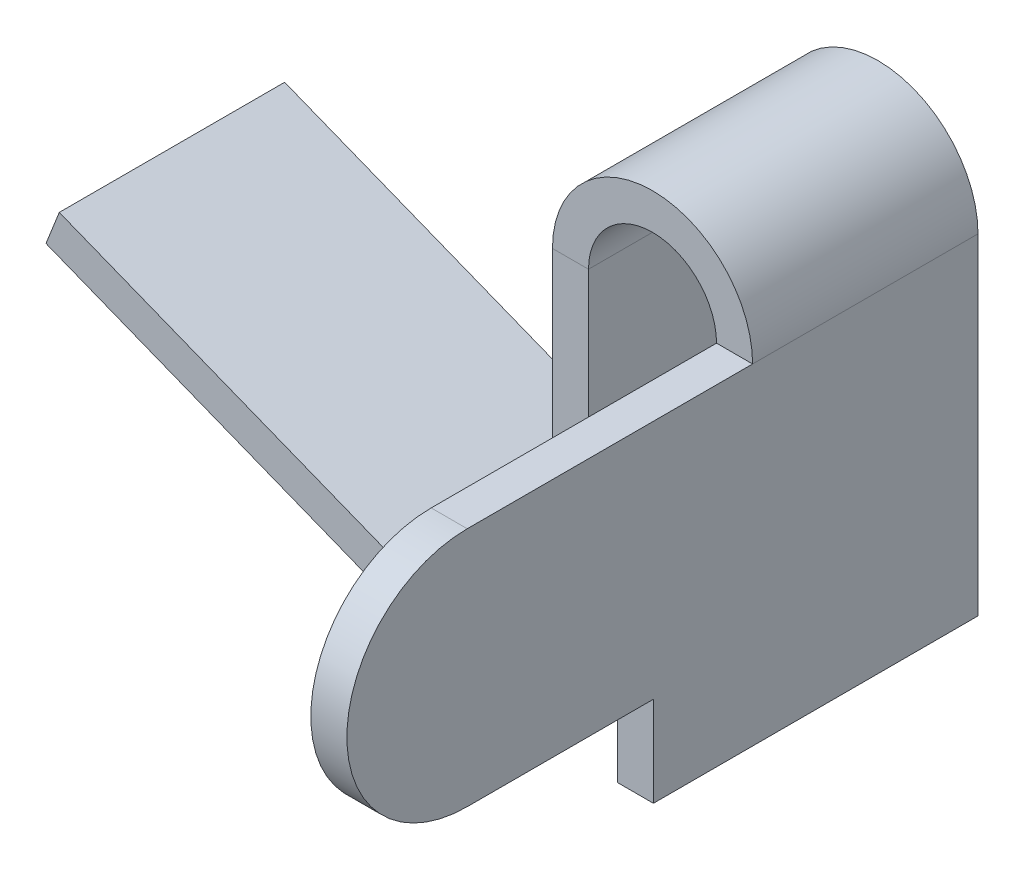
ISO-10303-21;
HEADER;
FILE_DESCRIPTION(('STEP AP214'),'2;1');
FILE_NAME('part.step','',(''),(''),'','','');
FILE_SCHEMA(('AUTOMOTIVE_DESIGN { 1 0 10303 214 1 1 1 1 }'));
ENDSEC;
DATA;
#1=APPLICATION_CONTEXT('core data for automotive mechanical design processes');
#2=APPLICATION_PROTOCOL_DEFINITION('international standard','automotive_design',2000,#1);
#3=PRODUCT_CONTEXT('',#1,'mechanical');
#4=PRODUCT('Part','Part','',(#3));
#5=PRODUCT_RELATED_PRODUCT_CATEGORY('part','',(#4));
#6=PRODUCT_DEFINITION_FORMATION('','',#4);
#7=PRODUCT_DEFINITION_CONTEXT('part definition',#1,'design');
#8=PRODUCT_DEFINITION('design','',#6,#7);
#9=PRODUCT_DEFINITION_SHAPE('','',#8);
#10=(LENGTH_UNIT() NAMED_UNIT(*) SI_UNIT(.MILLI.,.METRE.));
#11=(NAMED_UNIT(*) PLANE_ANGLE_UNIT() SI_UNIT($,.RADIAN.));
#12=(NAMED_UNIT(*) SI_UNIT($,.STERADIAN.) SOLID_ANGLE_UNIT());
#13=UNCERTAINTY_MEASURE_WITH_UNIT(LENGTH_MEASURE(1.E-05),#10,'distance_accuracy_value','');
#14=(GEOMETRIC_REPRESENTATION_CONTEXT(3) GLOBAL_UNCERTAINTY_ASSIGNED_CONTEXT((#13)) GLOBAL_UNIT_ASSIGNED_CONTEXT((#10,
#11,#12)) REPRESENTATION_CONTEXT('',''));
#15=CARTESIAN_POINT('',(0.,0.,0.));
#16=DIRECTION('',(0.,0.,1.));
#17=DIRECTION('',(1.,0.,0.));
#18=AXIS2_PLACEMENT_3D('',#15,#16,#17);
#19=CARTESIAN_POINT('',(0.709999999999978,2.335,5.665));
#20=DIRECTION('',(-1.,0.,0.));
#21=DIRECTION('',(0.,-1.,0.));
#22=AXIS2_PLACEMENT_3D('',#19,#20,#21);
#23=CYLINDRICAL_SURFACE('',#22,1.33499999999999);
#24=DIRECTION('',(1.,0.,0.));
#25=VECTOR('',#24,1.);
#26=CARTESIAN_POINT('',(0.709999999999999,3.66999999999999,5.665));
#27=LINE('',#26,#25);
#28=CARTESIAN_POINT('',(0.71,3.66999999999999,5.665));
#29=VERTEX_POINT('',#28);
#30=CARTESIAN_POINT('',(1.11,3.66999999999998,5.66500000000001));
#31=VERTEX_POINT('',#30);
#32=EDGE_CURVE('E205',#29,#31,#27,.T.);
#33=ORIENTED_EDGE('',*,*,#32,.F.);
#34=CARTESIAN_POINT('',(0.71,2.335,5.665));
#35=DIRECTION('',(-1.,0.,0.));
#36=DIRECTION('',(0.,0.,1.));
#37=AXIS2_PLACEMENT_3D('',#34,#35,#36);
#38=CIRCLE('',#37,1.33499999999999);
#39=CARTESIAN_POINT('',(0.71,1.,5.665));
#40=VERTEX_POINT('',#39);
#41=EDGE_CURVE('E43',#40,#29,#38,.T.);
#42=ORIENTED_EDGE('',*,*,#41,.F.);
#43=DIRECTION('',(1.,0.,0.));
#44=VECTOR('',#43,1.);
#45=CARTESIAN_POINT('',(0.71,1.,5.665));
#46=LINE('',#45,#44);
#47=CARTESIAN_POINT('',(1.11,1.,5.66500000000001));
#48=VERTEX_POINT('',#47);
#49=EDGE_CURVE('E208',#48,#40,#46,.F.);
#50=ORIENTED_EDGE('',*,*,#49,.F.);
#51=CARTESIAN_POINT('',(1.11,2.33499999999999,5.665));
#52=DIRECTION('',(-1.,0.,0.));
#53=DIRECTION('',(0.,0.,1.));
#54=AXIS2_PLACEMENT_3D('',#51,#52,#53);
#55=CIRCLE('',#54,1.33499999999999);
#56=EDGE_CURVE('E11',#31,#48,#55,.F.);
#57=ORIENTED_EDGE('',*,*,#56,.F.);
#58=EDGE_LOOP('',(#33,#42,#50,#57));
#59=FACE_BOUND('',#58,.T.);
#60=ADVANCED_FACE('F36',(#59),#23,.T.);
#61=CARTESIAN_POINT('',(0.71,0.,2.5));
#62=DIRECTION('',(-1.,0.,0.));
#63=DIRECTION('',(0.,0.,1.));
#64=AXIS2_PLACEMENT_3D('',#61,#62,#63);
#65=PLANE('',#64);
#66=DIRECTION('',(0.,0.,-1.));
#67=VECTOR('',#66,1.);
#68=CARTESIAN_POINT('',(0.71,1.,2.5));
#69=LINE('',#68,#67);
#70=CARTESIAN_POINT('',(0.71,1.,3.6));
#71=VERTEX_POINT('',#70);
#72=EDGE_CURVE('E214',#40,#71,#69,.T.);
#73=ORIENTED_EDGE('',*,*,#72,.F.);
#74=ORIENTED_EDGE('',*,*,#41,.T.);
#75=DIRECTION('',(0.,0.,-1.));
#76=VECTOR('',#75,1.);
#77=CARTESIAN_POINT('',(0.71,3.66999999999999,7.));
#78=LINE('',#77,#76);
#79=CARTESIAN_POINT('',(0.71,3.66999999999999,2.5));
#80=VERTEX_POINT('',#79);
#81=EDGE_CURVE('E213',#29,#80,#78,.T.);
#82=ORIENTED_EDGE('',*,*,#81,.T.);
#83=DIRECTION('',(0.,0.,-1.));
#84=VECTOR('',#83,1.);
#85=CARTESIAN_POINT('',(0.71,3.66999999999999,2.5));
#86=LINE('',#85,#84);
#87=CARTESIAN_POINT('',(0.71,3.66999999999999,0.));
#88=VERTEX_POINT('',#87);
#89=EDGE_CURVE('E166',#80,#88,#86,.T.);
#90=ORIENTED_EDGE('',*,*,#89,.T.);
#91=DIRECTION('',(0.,1.,0.));
#92=VECTOR('',#91,1.);
#93=CARTESIAN_POINT('',(0.71,0.,0.));
#94=LINE('',#93,#92);
#95=CARTESIAN_POINT('',(0.71,0.,0.));
#96=VERTEX_POINT('',#95);
#97=EDGE_CURVE('E270',#96,#88,#94,.T.);
#98=ORIENTED_EDGE('',*,*,#97,.F.);
#99=DIRECTION('',(0.,0.,-1.));
#100=VECTOR('',#99,1.);
#101=CARTESIAN_POINT('',(0.71,0.,2.5));
#102=LINE('',#101,#100);
#103=CARTESIAN_POINT('',(0.71,0.,3.6));
#104=VERTEX_POINT('',#103);
#105=EDGE_CURVE('E163',#104,#96,#102,.T.);
#106=ORIENTED_EDGE('',*,*,#105,.F.);
#107=DIRECTION('',(0.,-1.,0.));
#108=VECTOR('',#107,1.);
#109=CARTESIAN_POINT('',(0.71,0.,3.6));
#110=LINE('',#109,#108);
#111=EDGE_CURVE('E146',#71,#104,#110,.T.);
#112=ORIENTED_EDGE('',*,*,#111,.F.);
#113=EDGE_LOOP('',(#73,#74,#82,#90,#98,#106,#112));
#114=FACE_BOUND('',#113,.T.);
#115=ADVANCED_FACE('F211',(#114),#65,.T.);
#116=CARTESIAN_POINT('',(1.11,0.,2.5));
#117=DIRECTION('',(0.,-1.,0.));
#118=DIRECTION('',(0.,0.,-1.));
#119=AXIS2_PLACEMENT_3D('',#116,#117,#118);
#120=PLANE('',#119);
#121=DIRECTION('',(0.,0.,-1.));
#122=VECTOR('',#121,1.);
#123=CARTESIAN_POINT('',(1.11,0.,2.5));
#124=LINE('',#123,#122);
#125=CARTESIAN_POINT('',(1.11,0.,3.6));
#126=VERTEX_POINT('',#125);
#127=CARTESIAN_POINT('',(1.11,0.,0.));
#128=VERTEX_POINT('',#127);
#129=EDGE_CURVE('E154',#126,#128,#124,.T.);
#130=ORIENTED_EDGE('',*,*,#129,.F.);
#131=DIRECTION('',(-1.,0.,0.));
#132=VECTOR('',#131,1.);
#133=CARTESIAN_POINT('',(0.71,0.,3.6));
#134=LINE('',#133,#132);
#135=EDGE_CURVE('E139',#104,#126,#134,.F.);
#136=ORIENTED_EDGE('',*,*,#135,.F.);
#137=ORIENTED_EDGE('',*,*,#105,.T.);
#138=DIRECTION('',(-1.,0.,0.));
#139=VECTOR('',#138,1.);
#140=CARTESIAN_POINT('',(1.11,0.,0.));
#141=LINE('',#140,#139);
#142=EDGE_CURVE('E162',#128,#96,#141,.T.);
#143=ORIENTED_EDGE('',*,*,#142,.F.);
#144=EDGE_LOOP('',(#130,#136,#137,#143));
#145=FACE_BOUND('',#144,.T.);
#146=ADVANCED_FACE('F160',(#145),#120,.T.);
#147=CARTESIAN_POINT('',(1.11,0.,2.5));
#148=DIRECTION('',(-1.,0.,0.));
#149=DIRECTION('',(0.,0.,1.));
#150=AXIS2_PLACEMENT_3D('',#147,#148,#149);
#151=PLANE('',#150);
#152=DIRECTION('',(0.,0.,-1.));
#153=VECTOR('',#152,1.);
#154=CARTESIAN_POINT('',(1.11,3.66999999999998,7.));
#155=LINE('',#154,#153);
#156=CARTESIAN_POINT('',(1.11,3.66999999999998,2.5));
#157=VERTEX_POINT('',#156);
#158=EDGE_CURVE('E219',#31,#157,#155,.T.);
#159=ORIENTED_EDGE('',*,*,#158,.F.);
#160=ORIENTED_EDGE('',*,*,#56,.T.);
#161=DIRECTION('',(0.,0.,1.));
#162=VECTOR('',#161,1.);
#163=CARTESIAN_POINT('',(1.11,1.,2.5));
#164=LINE('',#163,#162);
#165=CARTESIAN_POINT('',(1.11,1.,3.6));
#166=VERTEX_POINT('',#165);
#167=EDGE_CURVE('E157',#48,#166,#164,.F.);
#168=ORIENTED_EDGE('',*,*,#167,.T.);
#169=DIRECTION('',(0.,1.,0.));
#170=VECTOR('',#169,1.);
#171=CARTESIAN_POINT('',(1.11,0.,3.6));
#172=LINE('',#171,#170);
#173=EDGE_CURVE('E143',#166,#126,#172,.F.);
#174=ORIENTED_EDGE('',*,*,#173,.T.);
#175=ORIENTED_EDGE('',*,*,#129,.T.);
#176=DIRECTION('',(0.,1.,0.));
#177=VECTOR('',#176,1.);
#178=CARTESIAN_POINT('',(1.11,0.,0.));
#179=LINE('',#178,#177);
#180=CARTESIAN_POINT('',(1.11,3.66999999999998,0.));
#181=VERTEX_POINT('',#180);
#182=EDGE_CURVE('E274',#128,#181,#179,.T.);
#183=ORIENTED_EDGE('',*,*,#182,.T.);
#184=DIRECTION('',(0.,0.,-1.));
#185=VECTOR('',#184,1.);
#186=CARTESIAN_POINT('',(1.11,3.66999999999998,2.5));
#187=LINE('',#186,#185);
#188=EDGE_CURVE('E164',#157,#181,#187,.T.);
#189=ORIENTED_EDGE('',*,*,#188,.F.);
#190=EDGE_LOOP('',(#159,#160,#168,#174,#175,#183,#189));
#191=FACE_BOUND('',#190,.T.);
#192=ADVANCED_FACE('F152',(#191),#151,.F.);
#193=CARTESIAN_POINT('',(-0.71,3.67,2.5));
#194=DIRECTION('',(0.,0.,1.));
#195=DIRECTION('',(1.,0.,0.));
#196=AXIS2_PLACEMENT_3D('',#193,#194,#195);
#197=PLANE('',#196);
#198=DIRECTION('',(-1.,0.,0.));
#199=VECTOR('',#198,1.);
#200=CARTESIAN_POINT('',(-0.71,3.67,2.5));
#201=LINE('',#200,#199);
#202=CARTESIAN_POINT('',(-0.71,3.67,2.5));
#203=VERTEX_POINT('',#202);
#204=CARTESIAN_POINT('',(-1.11,3.67,2.5));
#205=VERTEX_POINT('',#204);
#206=EDGE_CURVE('E203',#203,#205,#201,.T.);
#207=ORIENTED_EDGE('',*,*,#206,.F.);
#208=CARTESIAN_POINT('',(0.,3.67,2.5));
#209=DIRECTION('',(0.,0.,1.));
#210=DIRECTION('',(1.,0.,0.));
#211=AXIS2_PLACEMENT_3D('',#208,#209,#210);
#212=CIRCLE('',#211,0.71);
#213=EDGE_CURVE('E240',#80,#203,#212,.T.);
#214=ORIENTED_EDGE('',*,*,#213,.F.);
#215=DIRECTION('',(-1.,0.,0.));
#216=VECTOR('',#215,1.);
#217=CARTESIAN_POINT('',(1.11,3.66999999999998,2.5));
#218=LINE('',#217,#216);
#219=EDGE_CURVE('E200',#157,#80,#218,.T.);
#220=ORIENTED_EDGE('',*,*,#219,.F.);
#221=CARTESIAN_POINT('',(0.,3.67,2.5));
#222=DIRECTION('',(0.,0.,1.));
#223=DIRECTION('',(1.,0.,0.));
#224=AXIS2_PLACEMENT_3D('',#221,#222,#223);
#225=CIRCLE('',#224,1.11);
#226=EDGE_CURVE('E243',#157,#205,#225,.T.);
#227=ORIENTED_EDGE('',*,*,#226,.T.);
#228=EDGE_LOOP('',(#207,#214,#220,#227));
#229=FACE_BOUND('',#228,.T.);
#230=ADVANCED_FACE('F338',(#229),#197,.T.);
#231=CARTESIAN_POINT('',(1.11,3.66999999999998,2.5));
#232=DIRECTION('',(0.,0.,1.));
#233=DIRECTION('',(1.,0.,0.));
#234=AXIS2_PLACEMENT_3D('',#231,#232,#233);
#235=PLANE('',#234);
#236=DIRECTION('',(0.,-1.,0.));
#237=VECTOR('',#236,1.);
#238=CARTESIAN_POINT('',(-0.71,3.67,2.5));
#239=LINE('',#238,#237);
#240=CARTESIAN_POINT('',(-0.71,-0.5,2.5));
#241=VERTEX_POINT('',#240);
#242=EDGE_CURVE('E237',#203,#241,#239,.T.);
#243=ORIENTED_EDGE('',*,*,#242,.F.);
#244=ORIENTED_EDGE('',*,*,#206,.T.);
#245=DIRECTION('',(0.,-1.,0.));
#246=VECTOR('',#245,1.);
#247=CARTESIAN_POINT('',(-1.11,3.67,2.5));
#248=LINE('',#247,#246);
#249=CARTESIAN_POINT('',(-1.11,-0.5,2.5));
#250=VERTEX_POINT('',#249);
#251=EDGE_CURVE('E246',#205,#250,#248,.T.);
#252=ORIENTED_EDGE('',*,*,#251,.T.);
#253=DIRECTION('',(1.,0.,0.));
#254=VECTOR('',#253,1.);
#255=CARTESIAN_POINT('',(-1.11,-0.5,2.5));
#256=LINE('',#255,#254);
#257=EDGE_CURVE('E192',#250,#241,#256,.T.);
#258=ORIENTED_EDGE('',*,*,#257,.T.);
#259=EDGE_LOOP('',(#243,#244,#252,#258));
#260=FACE_BOUND('',#259,.T.);
#261=ADVANCED_FACE('F335',(#260),#235,.T.);
#262=CARTESIAN_POINT('',(0.71,3.66999999999999,0.));
#263=DIRECTION('',(0.,0.,-1.));
#264=DIRECTION('',(-1.,0.,0.));
#265=AXIS2_PLACEMENT_3D('',#262,#263,#264);
#266=PLANE('',#265);
#267=DIRECTION('',(1.,0.,0.));
#268=VECTOR('',#267,1.);
#269=CARTESIAN_POINT('',(0.71,3.66999999999999,0.));
#270=LINE('',#269,#268);
#271=EDGE_CURVE('E198',#88,#181,#270,.T.);
#272=ORIENTED_EDGE('',*,*,#271,.F.);
#273=CARTESIAN_POINT('',(0.,3.67,0.));
#274=DIRECTION('',(0.,0.,1.));
#275=DIRECTION('',(1.,0.,0.));
#276=AXIS2_PLACEMENT_3D('',#273,#274,#275);
#277=CIRCLE('',#276,0.71);
#278=CARTESIAN_POINT('',(-0.71,3.67,0.));
#279=VERTEX_POINT('',#278);
#280=EDGE_CURVE('E267',#88,#279,#277,.T.);
#281=ORIENTED_EDGE('',*,*,#280,.T.);
#282=DIRECTION('',(1.,0.,0.));
#283=VECTOR('',#282,1.);
#284=CARTESIAN_POINT('',(-1.11,3.67,0.));
#285=LINE('',#284,#283);
#286=CARTESIAN_POINT('',(-1.11,3.67,0.));
#287=VERTEX_POINT('',#286);
#288=EDGE_CURVE('E196',#287,#279,#285,.T.);
#289=ORIENTED_EDGE('',*,*,#288,.F.);
#290=CARTESIAN_POINT('',(0.,3.67,0.));
#291=DIRECTION('',(0.,0.,1.));
#292=DIRECTION('',(1.,0.,0.));
#293=AXIS2_PLACEMENT_3D('',#290,#291,#292);
#294=CIRCLE('',#293,1.11);
#295=EDGE_CURVE('E276',#181,#287,#294,.T.);
#296=ORIENTED_EDGE('',*,*,#295,.F.);
#297=EDGE_LOOP('',(#272,#281,#289,#296));
#298=FACE_BOUND('',#297,.T.);
#299=ADVANCED_FACE('F343',(#298),#266,.T.);
#300=CARTESIAN_POINT('',(-1.11,3.67,0.));
#301=DIRECTION('',(0.,0.,-1.));
#302=DIRECTION('',(-1.,0.,0.));
#303=AXIS2_PLACEMENT_3D('',#300,#301,#302);
#304=PLANE('',#303);
#305=ORIENTED_EDGE('',*,*,#97,.T.);
#306=ORIENTED_EDGE('',*,*,#271,.T.);
#307=ORIENTED_EDGE('',*,*,#182,.F.);
#308=ORIENTED_EDGE('',*,*,#142,.T.);
#309=EDGE_LOOP('',(#305,#306,#307,#308));
#310=FACE_BOUND('',#309,.T.);
#311=ADVANCED_FACE('F349',(#310),#304,.T.);
#312=CARTESIAN_POINT('',(-1.61274798484912,-1.1137372531073,2.5));
#313=DIRECTION('',(0.,0.,1.));
#314=DIRECTION('',(1.,0.,0.));
#315=AXIS2_PLACEMENT_3D('',#312,#313,#314);
#316=PLANE('',#315);
#317=DIRECTION('',(0.367799977044115,0.929904928950454,0.));
#318=VECTOR('',#317,1.);
#319=CARTESIAN_POINT('',(-1.61274798484912,-1.1137372531073,2.5));
#320=LINE('',#319,#318);
#321=CARTESIAN_POINT('',(-1.61274798484912,-1.1137372531073,2.5));
#322=VERTEX_POINT('',#321);
#323=CARTESIAN_POINT('',(-1.46562799403147,-0.741775281527118,2.5));
#324=VERTEX_POINT('',#323);
#325=EDGE_CURVE('E194',#322,#324,#320,.T.);
#326=ORIENTED_EDGE('',*,*,#325,.F.);
#327=CARTESIAN_POINT('',(-1.37,-0.5,2.5));
#328=DIRECTION('',(0.,0.,-1.));
#329=DIRECTION('',(-1.,0.,0.));
#330=AXIS2_PLACEMENT_3D('',#327,#328,#329);
#331=CIRCLE('',#330,0.66);
#332=EDGE_CURVE('E234',#241,#322,#331,.T.);
#333=ORIENTED_EDGE('',*,*,#332,.F.);
#334=ORIENTED_EDGE('',*,*,#257,.F.);
#335=CARTESIAN_POINT('',(-1.37,-0.5,2.5));
#336=DIRECTION('',(0.,0.,1.));
#337=DIRECTION('',(1.,0.,0.));
#338=AXIS2_PLACEMENT_3D('',#335,#336,#337);
#339=CIRCLE('',#338,0.26);
#340=EDGE_CURVE('E249',#250,#324,#339,.F.);
#341=ORIENTED_EDGE('',*,*,#340,.T.);
#342=EDGE_LOOP('',(#326,#333,#334,#341));
#343=FACE_BOUND('',#342,.T.);
#344=ADVANCED_FACE('F333',(#343),#316,.T.);
#345=CARTESIAN_POINT('',(-1.11,-0.5,2.5));
#346=DIRECTION('',(0.,0.,1.));
#347=DIRECTION('',(1.,0.,0.));
#348=AXIS2_PLACEMENT_3D('',#345,#346,#347);
#349=PLANE('',#348);
#350=DIRECTION('',(-0.929904928950454,0.367799977044115,0.));
#351=VECTOR('',#350,1.);
#352=CARTESIAN_POINT('',(-1.61274798484912,-1.1137372531073,2.5));
#353=LINE('',#352,#351);
#354=CARTESIAN_POINT('',(-6.72722509407661,0.909162620635334,2.5));
#355=VERTEX_POINT('',#354);
#356=EDGE_CURVE('E231',#322,#355,#353,.T.);
#357=ORIENTED_EDGE('',*,*,#356,.F.);
#358=ORIENTED_EDGE('',*,*,#325,.T.);
#359=DIRECTION('',(-0.929904928950454,0.367799977044115,0.));
#360=VECTOR('',#359,1.);
#361=CARTESIAN_POINT('',(-1.46562799403147,-0.741775281527118,2.5));
#362=LINE('',#361,#360);
#363=CARTESIAN_POINT('',(-6.58010510325897,1.28112459221552,2.5));
#364=VERTEX_POINT('',#363);
#365=EDGE_CURVE('E225',#324,#364,#362,.T.);
#366=ORIENTED_EDGE('',*,*,#365,.T.);
#367=DIRECTION('',(0.367799977044113,0.929904928950455,0.));
#368=VECTOR('',#367,1.);
#369=CARTESIAN_POINT('',(-6.72722509407661,0.909162620635334,2.5));
#370=LINE('',#369,#368);
#371=EDGE_CURVE('E227',#355,#364,#370,.T.);
#372=ORIENTED_EDGE('',*,*,#371,.F.);
#373=EDGE_LOOP('',(#357,#358,#366,#372));
#374=FACE_BOUND('',#373,.T.);
#375=ADVANCED_FACE('F331',(#374),#349,.T.);
#376=CARTESIAN_POINT('',(-0.71,-0.5,0.));
#377=DIRECTION('',(0.,0.,-1.));
#378=DIRECTION('',(-1.,0.,0.));
#379=AXIS2_PLACEMENT_3D('',#376,#377,#378);
#380=PLANE('',#379);
#381=DIRECTION('',(-1.,0.,0.));
#382=VECTOR('',#381,1.);
#383=CARTESIAN_POINT('',(-0.71,-0.5,0.));
#384=LINE('',#383,#382);
#385=CARTESIAN_POINT('',(-0.71,-0.5,0.));
#386=VERTEX_POINT('',#385);
#387=CARTESIAN_POINT('',(-1.11,-0.5,0.));
#388=VERTEX_POINT('',#387);
#389=EDGE_CURVE('E190',#386,#388,#384,.T.);
#390=ORIENTED_EDGE('',*,*,#389,.F.);
#391=CARTESIAN_POINT('',(-1.37,-0.5,0.));
#392=DIRECTION('',(0.,0.,-1.));
#393=DIRECTION('',(-1.,0.,0.));
#394=AXIS2_PLACEMENT_3D('',#391,#392,#393);
#395=CIRCLE('',#394,0.66);
#396=CARTESIAN_POINT('',(-1.61274798484912,-1.1137372531073,0.));
#397=VERTEX_POINT('',#396);
#398=EDGE_CURVE('E261',#386,#397,#395,.T.);
#399=ORIENTED_EDGE('',*,*,#398,.T.);
#400=DIRECTION('',(-0.367799977044115,-0.929904928950454,0.));
#401=VECTOR('',#400,1.);
#402=CARTESIAN_POINT('',(-1.46562799403147,-0.741775281527118,0.));
#403=LINE('',#402,#401);
#404=CARTESIAN_POINT('',(-1.46562799403147,-0.741775281527118,0.));
#405=VERTEX_POINT('',#404);
#406=EDGE_CURVE('E188',#405,#397,#403,.T.);
#407=ORIENTED_EDGE('',*,*,#406,.F.);
#408=CARTESIAN_POINT('',(-1.37,-0.5,0.));
#409=DIRECTION('',(0.,0.,1.));
#410=DIRECTION('',(1.,0.,0.));
#411=AXIS2_PLACEMENT_3D('',#408,#409,#410);
#412=CIRCLE('',#411,0.26);
#413=EDGE_CURVE('E228',#388,#405,#412,.F.);
#414=ORIENTED_EDGE('',*,*,#413,.F.);
#415=EDGE_LOOP('',(#390,#399,#407,#414));
#416=FACE_BOUND('',#415,.T.);
#417=ADVANCED_FACE('F302',(#416),#380,.T.);
#418=CARTESIAN_POINT('',(-1.46562799403147,-0.741775281527118,0.));
#419=DIRECTION('',(0.,0.,-1.));
#420=DIRECTION('',(-1.,0.,0.));
#421=AXIS2_PLACEMENT_3D('',#418,#419,#420);
#422=PLANE('',#421);
#423=DIRECTION('',(0.,-1.,0.));
#424=VECTOR('',#423,1.);
#425=CARTESIAN_POINT('',(-0.71,3.67,0.));
#426=LINE('',#425,#424);
#427=EDGE_CURVE('E264',#279,#386,#426,.T.);
#428=ORIENTED_EDGE('',*,*,#427,.T.);
#429=ORIENTED_EDGE('',*,*,#389,.T.);
#430=DIRECTION('',(0.,-1.,0.));
#431=VECTOR('',#430,1.);
#432=CARTESIAN_POINT('',(-1.11,3.67,0.));
#433=LINE('',#432,#431);
#434=EDGE_CURVE('E279',#287,#388,#433,.T.);
#435=ORIENTED_EDGE('',*,*,#434,.F.);
#436=ORIENTED_EDGE('',*,*,#288,.T.);
#437=EDGE_LOOP('',(#428,#429,#435,#436));
#438=FACE_BOUND('',#437,.T.);
#439=ADVANCED_FACE('F298',(#438),#422,.T.);
#440=CARTESIAN_POINT('',(-1.46562799403147,-0.741775281527118,2.5));
#441=DIRECTION('',(-0.367799977044115,-0.929904928950454,0.));
#442=DIRECTION('',(0.929904928950454,-0.367799977044115,0.));
#443=AXIS2_PLACEMENT_3D('',#440,#441,#442);
#444=PLANE('',#443);
#445=DIRECTION('',(-0.929904928950454,0.367799977044115,0.));
#446=VECTOR('',#445,1.);
#447=CARTESIAN_POINT('',(-1.46562799403147,-0.741775281527118,0.));
#448=LINE('',#447,#446);
#449=CARTESIAN_POINT('',(-6.58010510325897,1.28112459221552,0.));
#450=VERTEX_POINT('',#449);
#451=EDGE_CURVE('E221',#405,#450,#448,.T.);
#452=ORIENTED_EDGE('',*,*,#451,.T.);
#453=DIRECTION('',(0.,0.,-1.));
#454=VECTOR('',#453,1.);
#455=CARTESIAN_POINT('',(-6.58010510325897,1.28112459221552,2.5));
#456=LINE('',#455,#454);
#457=EDGE_CURVE('E186',#364,#450,#456,.T.);
#458=ORIENTED_EDGE('',*,*,#457,.F.);
#459=ORIENTED_EDGE('',*,*,#365,.F.);
#460=DIRECTION('',(0.,0.,-1.));
#461=VECTOR('',#460,1.);
#462=CARTESIAN_POINT('',(-1.46562799403147,-0.741775281527118,2.5));
#463=LINE('',#462,#461);
#464=EDGE_CURVE('E252',#324,#405,#463,.T.);
#465=ORIENTED_EDGE('',*,*,#464,.T.);
#466=EDGE_LOOP('',(#452,#458,#459,#465));
#467=FACE_BOUND('',#466,.T.);
#468=ADVANCED_FACE('F327',(#467),#444,.F.);
#469=CARTESIAN_POINT('',(-6.72722509407661,0.909162620635334,2.5));
#470=DIRECTION('',(-0.929904928950455,0.367799977044113,0.));
#471=DIRECTION('',(-0.367799977044113,-0.929904928950455,0.));
#472=AXIS2_PLACEMENT_3D('',#469,#470,#471);
#473=PLANE('',#472);
#474=DIRECTION('',(0.367799977044113,0.929904928950455,0.));
#475=VECTOR('',#474,1.);
#476=CARTESIAN_POINT('',(-6.72722509407661,0.909162620635334,0.));
#477=LINE('',#476,#475);
#478=CARTESIAN_POINT('',(-6.72722509407661,0.909162620635334,0.));
#479=VERTEX_POINT('',#478);
#480=EDGE_CURVE('E255',#479,#450,#477,.T.);
#481=ORIENTED_EDGE('',*,*,#480,.F.);
#482=DIRECTION('',(0.,0.,-1.));
#483=VECTOR('',#482,1.);
#484=CARTESIAN_POINT('',(-6.72722509407661,0.909162620635334,2.5));
#485=LINE('',#484,#483);
#486=EDGE_CURVE('E184',#355,#479,#485,.T.);
#487=ORIENTED_EDGE('',*,*,#486,.F.);
#488=ORIENTED_EDGE('',*,*,#371,.T.);
#489=ORIENTED_EDGE('',*,*,#457,.T.);
#490=EDGE_LOOP('',(#481,#487,#488,#489));
#491=FACE_BOUND('',#490,.T.);
#492=ADVANCED_FACE('F381',(#491),#473,.T.);
#493=CARTESIAN_POINT('',(-1.61274798484912,-1.1137372531073,2.5));
#494=DIRECTION('',(-0.367799977044115,-0.929904928950454,0.));
#495=DIRECTION('',(0.929904928950454,-0.367799977044115,0.));
#496=AXIS2_PLACEMENT_3D('',#493,#494,#495);
#497=PLANE('',#496);
#498=DIRECTION('',(-0.929904928950454,0.367799977044115,0.));
#499=VECTOR('',#498,1.);
#500=CARTESIAN_POINT('',(-1.61274798484912,-1.1137372531073,0.));
#501=LINE('',#500,#499);
#502=EDGE_CURVE('E258',#397,#479,#501,.T.);
#503=ORIENTED_EDGE('',*,*,#502,.F.);
#504=DIRECTION('',(0.,0.,-1.));
#505=VECTOR('',#504,1.);
#506=CARTESIAN_POINT('',(-1.61274798484912,-1.1137372531073,2.5));
#507=LINE('',#506,#505);
#508=EDGE_CURVE('E181',#322,#397,#507,.T.);
#509=ORIENTED_EDGE('',*,*,#508,.F.);
#510=ORIENTED_EDGE('',*,*,#356,.T.);
#511=ORIENTED_EDGE('',*,*,#486,.T.);
#512=EDGE_LOOP('',(#503,#509,#510,#511));
#513=FACE_BOUND('',#512,.T.);
#514=ADVANCED_FACE('F316',(#513),#497,.T.);
#515=CARTESIAN_POINT('',(-1.37,-0.5,2.5));
#516=DIRECTION('',(0.,0.,-1.));
#517=DIRECTION('',(-1.,0.,0.));
#518=AXIS2_PLACEMENT_3D('',#515,#516,#517);
#519=CYLINDRICAL_SURFACE('',#518,0.66);
#520=ORIENTED_EDGE('',*,*,#398,.F.);
#521=DIRECTION('',(0.,0.,-1.));
#522=VECTOR('',#521,1.);
#523=CARTESIAN_POINT('',(-0.71,-0.5,2.5));
#524=LINE('',#523,#522);
#525=EDGE_CURVE('E178',#241,#386,#524,.T.);
#526=ORIENTED_EDGE('',*,*,#525,.F.);
#527=ORIENTED_EDGE('',*,*,#332,.T.);
#528=ORIENTED_EDGE('',*,*,#508,.T.);
#529=EDGE_LOOP('',(#520,#526,#527,#528));
#530=FACE_BOUND('',#529,.T.);
#531=ADVANCED_FACE('F311',(#530),#519,.T.);
#532=CARTESIAN_POINT('',(-0.71,3.67,2.5));
#533=DIRECTION('',(1.,0.,0.));
#534=DIRECTION('',(0.,1.,0.));
#535=AXIS2_PLACEMENT_3D('',#532,#533,#534);
#536=PLANE('',#535);
#537=ORIENTED_EDGE('',*,*,#427,.F.);
#538=DIRECTION('',(0.,0.,-1.));
#539=VECTOR('',#538,1.);
#540=CARTESIAN_POINT('',(-0.71,3.67,2.5));
#541=LINE('',#540,#539);
#542=EDGE_CURVE('E175',#203,#279,#541,.T.);
#543=ORIENTED_EDGE('',*,*,#542,.F.);
#544=ORIENTED_EDGE('',*,*,#242,.T.);
#545=ORIENTED_EDGE('',*,*,#525,.T.);
#546=EDGE_LOOP('',(#537,#543,#544,#545));
#547=FACE_BOUND('',#546,.T.);
#548=ADVANCED_FACE('F306',(#547),#536,.T.);
#549=CARTESIAN_POINT('',(0.,3.67,2.5));
#550=DIRECTION('',(0.,0.,-1.));
#551=DIRECTION('',(-1.,0.,0.));
#552=AXIS2_PLACEMENT_3D('',#549,#550,#551);
#553=CYLINDRICAL_SURFACE('',#552,0.71);
#554=ORIENTED_EDGE('',*,*,#280,.F.);
#555=ORIENTED_EDGE('',*,*,#89,.F.);
#556=ORIENTED_EDGE('',*,*,#213,.T.);
#557=ORIENTED_EDGE('',*,*,#542,.T.);
#558=EDGE_LOOP('',(#554,#555,#556,#557));
#559=FACE_BOUND('',#558,.T.);
#560=ADVANCED_FACE('F346',(#559),#553,.F.);
#561=CARTESIAN_POINT('',(0.,3.67,2.5));
#562=DIRECTION('',(0.,0.,-1.));
#563=DIRECTION('',(-1.,0.,0.));
#564=AXIS2_PLACEMENT_3D('',#561,#562,#563);
#565=CYLINDRICAL_SURFACE('',#564,1.11);
#566=ORIENTED_EDGE('',*,*,#295,.T.);
#567=DIRECTION('',(0.,0.,-1.));
#568=VECTOR('',#567,1.);
#569=CARTESIAN_POINT('',(-1.11,3.67,2.5));
#570=LINE('',#569,#568);
#571=EDGE_CURVE('E169',#205,#287,#570,.T.);
#572=ORIENTED_EDGE('',*,*,#571,.F.);
#573=ORIENTED_EDGE('',*,*,#226,.F.);
#574=ORIENTED_EDGE('',*,*,#188,.T.);
#575=EDGE_LOOP('',(#566,#572,#573,#574));
#576=FACE_BOUND('',#575,.T.);
#577=ADVANCED_FACE('F340',(#576),#565,.T.);
#578=CARTESIAN_POINT('',(-1.11,3.67,2.5));
#579=DIRECTION('',(1.,0.,0.));
#580=DIRECTION('',(0.,1.,0.));
#581=AXIS2_PLACEMENT_3D('',#578,#579,#580);
#582=PLANE('',#581);
#583=ORIENTED_EDGE('',*,*,#434,.T.);
#584=DIRECTION('',(0.,0.,-1.));
#585=VECTOR('',#584,1.);
#586=CARTESIAN_POINT('',(-1.11,-0.5,2.5));
#587=LINE('',#586,#585);
#588=EDGE_CURVE('E286',#250,#388,#587,.T.);
#589=ORIENTED_EDGE('',*,*,#588,.F.);
#590=ORIENTED_EDGE('',*,*,#251,.F.);
#591=ORIENTED_EDGE('',*,*,#571,.T.);
#592=EDGE_LOOP('',(#583,#589,#590,#591));
#593=FACE_BOUND('',#592,.T.);
#594=ADVANCED_FACE('F293',(#593),#582,.F.);
#595=CARTESIAN_POINT('',(-1.37,-0.5,2.5));
#596=DIRECTION('',(0.,0.,-1.));
#597=DIRECTION('',(-1.,0.,0.));
#598=AXIS2_PLACEMENT_3D('',#595,#596,#597);
#599=CYLINDRICAL_SURFACE('',#598,0.26);
#600=ORIENTED_EDGE('',*,*,#413,.T.);
#601=ORIENTED_EDGE('',*,*,#464,.F.);
#602=ORIENTED_EDGE('',*,*,#340,.F.);
#603=ORIENTED_EDGE('',*,*,#588,.T.);
#604=EDGE_LOOP('',(#600,#601,#602,#603));
#605=FACE_BOUND('',#604,.T.);
#606=ADVANCED_FACE('F323',(#605),#599,.F.);
#607=CARTESIAN_POINT('',(-1.37,-0.5,0.));
#608=DIRECTION('',(0.,0.,-1.));
#609=DIRECTION('',(-1.,0.,0.));
#610=AXIS2_PLACEMENT_3D('',#607,#608,#609);
#611=PLANE('',#610);
#612=ORIENTED_EDGE('',*,*,#451,.F.);
#613=ORIENTED_EDGE('',*,*,#406,.T.);
#614=ORIENTED_EDGE('',*,*,#502,.T.);
#615=ORIENTED_EDGE('',*,*,#480,.T.);
#616=EDGE_LOOP('',(#612,#613,#614,#615));
#617=FACE_BOUND('',#616,.T.);
#618=ADVANCED_FACE('F320',(#617),#611,.T.);
#619=CARTESIAN_POINT('',(1.11,3.66999999999998,7.));
#620=DIRECTION('',(0.,-1.,0.));
#621=DIRECTION('',(1.,0.,0.));
#622=AXIS2_PLACEMENT_3D('',#619,#620,#621);
#623=PLANE('',#622);
#624=ORIENTED_EDGE('',*,*,#81,.F.);
#625=ORIENTED_EDGE('',*,*,#32,.T.);
#626=ORIENTED_EDGE('',*,*,#158,.T.);
#627=ORIENTED_EDGE('',*,*,#219,.T.);
#628=EDGE_LOOP('',(#624,#625,#626,#627));
#629=FACE_BOUND('',#628,.T.);
#630=ADVANCED_FACE('F216',(#629),#623,.F.);
#631=CARTESIAN_POINT('',(0.71,0.,3.6));
#632=DIRECTION('',(0.,0.,-1.));
#633=DIRECTION('',(0.,-1.,0.));
#634=AXIS2_PLACEMENT_3D('',#631,#632,#633);
#635=PLANE('',#634);
#636=DIRECTION('',(-1.,0.,0.));
#637=VECTOR('',#636,1.);
#638=CARTESIAN_POINT('',(0.71,1.,3.6));
#639=LINE('',#638,#637);
#640=EDGE_CURVE('E150',#71,#166,#639,.F.);
#641=ORIENTED_EDGE('',*,*,#640,.F.);
#642=ORIENTED_EDGE('',*,*,#111,.T.);
#643=ORIENTED_EDGE('',*,*,#135,.T.);
#644=ORIENTED_EDGE('',*,*,#173,.F.);
#645=EDGE_LOOP('',(#641,#642,#643,#644));
#646=FACE_BOUND('',#645,.T.);
#647=ADVANCED_FACE('F142',(#646),#635,.F.);
#648=CARTESIAN_POINT('',(0.71,1.,2.5));
#649=DIRECTION('',(0.,1.,0.));
#650=DIRECTION('',(0.,0.,-1.));
#651=AXIS2_PLACEMENT_3D('',#648,#649,#650);
#652=PLANE('',#651);
#653=ORIENTED_EDGE('',*,*,#167,.F.);
#654=ORIENTED_EDGE('',*,*,#49,.T.);
#655=ORIENTED_EDGE('',*,*,#72,.T.);
#656=ORIENTED_EDGE('',*,*,#640,.T.);
#657=EDGE_LOOP('',(#653,#654,#655,#656));
#658=FACE_BOUND('',#657,.T.);
#659=ADVANCED_FACE('F354',(#658),#652,.F.);
#660=CLOSED_SHELL('',(#60,#115,#146,#192,#230,#261,#299,#311,#344,#375,#417,#439,#468,#492,#514,
#531,#548,#560,#577,#594,#606,#618,#630,#647,#659));
#661=MANIFOLD_SOLID_BREP('B2',#660);
#662=ADVANCED_BREP_SHAPE_REPRESENTATION('',(#18,#661),#14);
#663=SHAPE_DEFINITION_REPRESENTATION(#9,#662);
ENDSEC;
END-ISO-10303-21;
